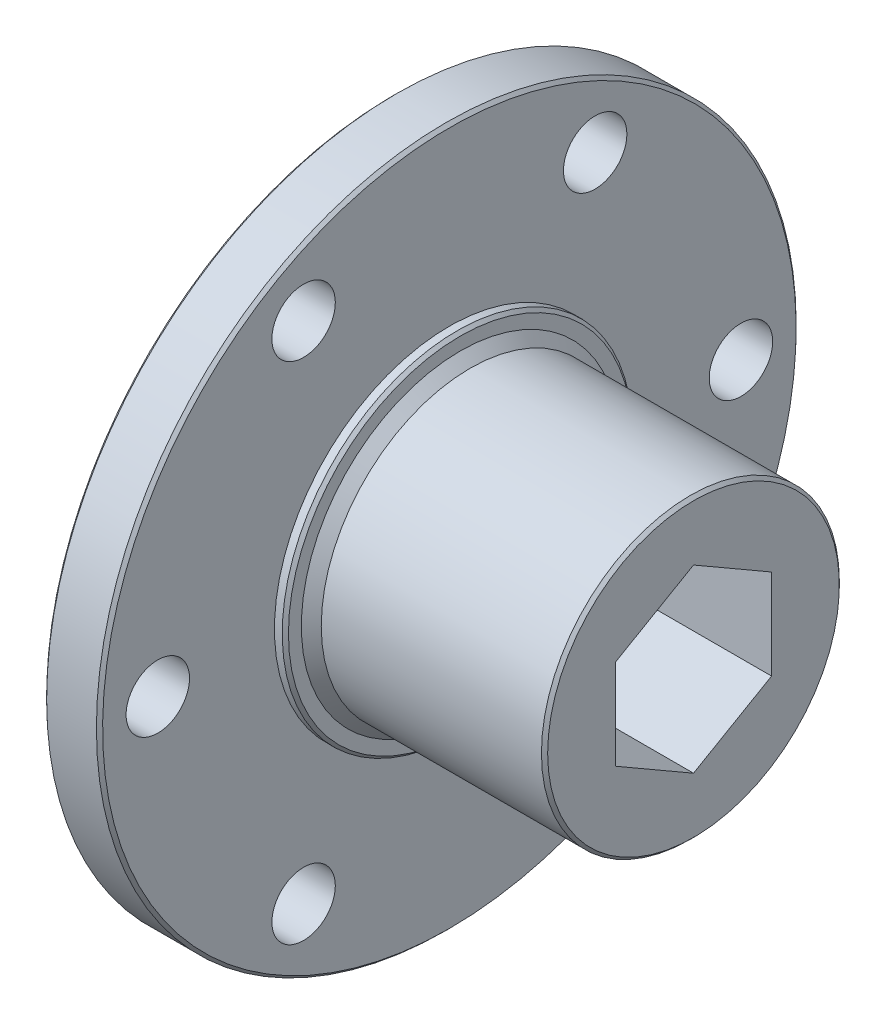
ISO-10303-21;
HEADER;
FILE_DESCRIPTION(('STEP AP214'),'2;1');
FILE_NAME('part.step','',(''),(''),'','','');
FILE_SCHEMA(('AUTOMOTIVE_DESIGN { 1 0 10303 214 1 1 1 1 }'));
ENDSEC;
DATA;
#1=APPLICATION_CONTEXT('core data for automotive mechanical design processes');
#2=APPLICATION_PROTOCOL_DEFINITION('international standard','automotive_design',2000,#1);
#3=PRODUCT_CONTEXT('',#1,'mechanical');
#4=PRODUCT('Part','Part','',(#3));
#5=PRODUCT_RELATED_PRODUCT_CATEGORY('part','',(#4));
#6=PRODUCT_DEFINITION_FORMATION('','',#4);
#7=PRODUCT_DEFINITION_CONTEXT('part definition',#1,'design');
#8=PRODUCT_DEFINITION('design','',#6,#7);
#9=PRODUCT_DEFINITION_SHAPE('','',#8);
#10=(LENGTH_UNIT() NAMED_UNIT(*) SI_UNIT(.MILLI.,.METRE.));
#11=(NAMED_UNIT(*) PLANE_ANGLE_UNIT() SI_UNIT($,.RADIAN.));
#12=(NAMED_UNIT(*) SI_UNIT($,.STERADIAN.) SOLID_ANGLE_UNIT());
#13=UNCERTAINTY_MEASURE_WITH_UNIT(LENGTH_MEASURE(1.E-05),#10,'distance_accuracy_value','');
#14=(GEOMETRIC_REPRESENTATION_CONTEXT(3) GLOBAL_UNCERTAINTY_ASSIGNED_CONTEXT((#13)) GLOBAL_UNIT_ASSIGNED_CONTEXT((#10,
#11,#12)) REPRESENTATION_CONTEXT('',''));
#15=CARTESIAN_POINT('',(0.,0.,0.));
#16=DIRECTION('',(0.,0.,1.));
#17=DIRECTION('',(1.,0.,0.));
#18=AXIS2_PLACEMENT_3D('',#15,#16,#17);
#19=CARTESIAN_POINT('',(6.01493375394323,0.,0.));
#20=DIRECTION('',(-1.,0.,0.));
#21=DIRECTION('',(0.,0.,1.));
#22=AXIS2_PLACEMENT_3D('',#19,#20,#21);
#23=CYLINDRICAL_SURFACE('',#22,12.1666);
#24=CARTESIAN_POINT('',(5.76093375394327,0.,0.));
#25=DIRECTION('',(-1.,0.,0.));
#26=DIRECTION('',(0.,0.,1.));
#27=AXIS2_PLACEMENT_3D('',#24,#25,#26);
#28=CIRCLE('',#27,12.1666);
#29=CARTESIAN_POINT('',(5.76093375394327,0.,12.1666));
#30=VERTEX_POINT('',#29);
#31=EDGE_CURVE('E102',#30,#30,#28,.F.);
#32=ORIENTED_EDGE('',*,*,#31,.F.);
#33=EDGE_LOOP('',(#32));
#34=FACE_BOUND('',#33,.T.);
#35=CARTESIAN_POINT('',(-12.2222662460567,0.,0.));
#36=DIRECTION('',(-1.,0.,0.));
#37=DIRECTION('',(0.,0.,1.));
#38=AXIS2_PLACEMENT_3D('',#35,#36,#37);
#39=CIRCLE('',#38,12.1666);
#40=CARTESIAN_POINT('',(-12.2222662460567,0.,12.1666));
#41=VERTEX_POINT('',#40);
#42=EDGE_CURVE('E99',#41,#41,#39,.T.);
#43=ORIENTED_EDGE('',*,*,#42,.F.);
#44=EDGE_LOOP('',(#43));
#45=FACE_BOUND('',#44,.T.);
#46=ADVANCED_FACE('F18',(#34,#45),#23,.T.);
#47=CARTESIAN_POINT('',(5.76093375394327,0.,0.));
#48=DIRECTION('',(-1.,0.,0.));
#49=DIRECTION('',(0.,0.,1.));
#50=AXIS2_PLACEMENT_3D('',#47,#48,#49);
#51=CONICAL_SURFACE('',#50,12.1666,0.785398163397465);
#52=ORIENTED_EDGE('',*,*,#31,.T.);
#53=EDGE_LOOP('',(#52));
#54=FACE_BOUND('',#53,.T.);
#55=CARTESIAN_POINT('',(6.01493375394323,0.,0.));
#56=DIRECTION('',(-1.,0.,0.));
#57=DIRECTION('',(0.,0.,1.));
#58=AXIS2_PLACEMENT_3D('',#55,#56,#57);
#59=CIRCLE('',#58,11.9126);
#60=CARTESIAN_POINT('',(6.01493375394323,0.,11.9126));
#61=VERTEX_POINT('',#60);
#62=EDGE_CURVE('E21',#61,#61,#59,.F.);
#63=ORIENTED_EDGE('',*,*,#62,.F.);
#64=EDGE_LOOP('',(#63));
#65=FACE_BOUND('',#64,.T.);
#66=ADVANCED_FACE('F165',(#54,#65),#51,.T.);
#67=CARTESIAN_POINT('',(-13.0350662460568,0.,0.));
#68=DIRECTION('',(-1.,0.,0.));
#69=DIRECTION('',(0.,-1.,0.));
#70=AXIS2_PLACEMENT_3D('',#67,#68,#69);
#71=CONICAL_SURFACE('',#70,12.9794,0.785398163397438);
#72=ORIENTED_EDGE('',*,*,#42,.T.);
#73=EDGE_LOOP('',(#72));
#74=FACE_BOUND('',#73,.T.);
#75=CARTESIAN_POINT('',(-13.0350662460568,0.,0.));
#76=DIRECTION('',(-1.,0.,0.));
#77=DIRECTION('',(0.,-1.,0.));
#78=AXIS2_PLACEMENT_3D('',#75,#76,#77);
#79=CIRCLE('',#78,12.9794);
#80=CARTESIAN_POINT('',(-13.0350662460568,-12.9794,0.));
#81=VERTEX_POINT('',#80);
#82=EDGE_CURVE('E84',#81,#81,#79,.T.);
#83=ORIENTED_EDGE('',*,*,#82,.F.);
#84=EDGE_LOOP('',(#83));
#85=FACE_BOUND('',#84,.T.);
#86=ADVANCED_FACE('F167',(#74,#85),#71,.T.);
#87=CARTESIAN_POINT('',(6.01493375394323,0.,0.));
#88=DIRECTION('',(1.,0.,0.));
#89=DIRECTION('',(0.,0.,-1.));
#90=AXIS2_PLACEMENT_3D('',#87,#88,#89);
#91=PLANE('',#90);
#92=DIRECTION('',(0.,1.,0.));
#93=VECTOR('',#92,1.);
#94=CARTESIAN_POINT('',(6.01493375394323,-3.68085890619153,-6.37539999999999));
#95=LINE('',#94,#93);
#96=CARTESIAN_POINT('',(6.01493375394323,3.68081890619155,-6.37539999999999));
#97=VERTEX_POINT('',#96);
#98=CARTESIAN_POINT('',(6.01493375394323,-3.68085890619153,-6.37539999999999));
#99=VERTEX_POINT('',#98);
#100=EDGE_CURVE('E93',#97,#99,#95,.F.);
#101=ORIENTED_EDGE('',*,*,#100,.T.);
#102=DIRECTION('',(0.,0.500000000000001,-0.866025403784438));
#103=VECTOR('',#102,1.);
#104=CARTESIAN_POINT('',(6.01493375394323,-7.36169781238308,0.));
#105=LINE('',#104,#103);
#106=CARTESIAN_POINT('',(6.01493375394323,-7.36169781238308,0.));
#107=VERTEX_POINT('',#106);
#108=EDGE_CURVE('E69',#99,#107,#105,.F.);
#109=ORIENTED_EDGE('',*,*,#108,.T.);
#110=DIRECTION('',(0.,-0.500000000000001,-0.866025403784438));
#111=VECTOR('',#110,1.);
#112=CARTESIAN_POINT('',(6.01493375394323,-3.68085890619153,6.3754));
#113=LINE('',#112,#111);
#114=CARTESIAN_POINT('',(6.01493375394323,-3.68085890619153,6.3754));
#115=VERTEX_POINT('',#114);
#116=EDGE_CURVE('E75',#107,#115,#113,.F.);
#117=ORIENTED_EDGE('',*,*,#116,.T.);
#118=DIRECTION('',(0.,-1.,0.));
#119=VECTOR('',#118,1.);
#120=CARTESIAN_POINT('',(6.01493375394323,3.68081890619155,6.3754));
#121=LINE('',#120,#119);
#122=CARTESIAN_POINT('',(6.01493375394323,3.68081890619155,6.3754));
#123=VERTEX_POINT('',#122);
#124=EDGE_CURVE('E158',#115,#123,#121,.F.);
#125=ORIENTED_EDGE('',*,*,#124,.T.);
#126=DIRECTION('',(0.,-0.500000000000001,0.866025403784438));
#127=VECTOR('',#126,1.);
#128=CARTESIAN_POINT('',(6.01493375394323,7.3616578123831,0.));
#129=LINE('',#128,#127);
#130=CARTESIAN_POINT('',(6.01493375394323,7.3616578123831,0.));
#131=VERTEX_POINT('',#130);
#132=EDGE_CURVE('E455',#123,#131,#129,.F.);
#133=ORIENTED_EDGE('',*,*,#132,.T.);
#134=DIRECTION('',(0.,0.500000000000001,0.866025403784438));
#135=VECTOR('',#134,1.);
#136=CARTESIAN_POINT('',(6.01493375394323,3.68081890619155,-6.37539999999999));
#137=LINE('',#136,#135);
#138=EDGE_CURVE('E461',#131,#97,#137,.F.);
#139=ORIENTED_EDGE('',*,*,#138,.T.);
#140=EDGE_LOOP('',(#101,#109,#117,#125,#133,#139));
#141=FACE_BOUND('',#140,.T.);
#142=ORIENTED_EDGE('',*,*,#62,.T.);
#143=EDGE_LOOP('',(#142));
#144=FACE_BOUND('',#143,.T.);
#145=ADVANCED_FACE('F90',(#141,#144),#91,.T.);
#146=CARTESIAN_POINT('',(-13.0350662460568,28.575,0.));
#147=DIRECTION('',(1.,0.,0.));
#148=DIRECTION('',(0.,0.,-1.));
#149=AXIS2_PLACEMENT_3D('',#146,#147,#148);
#150=PLANE('',#149);
#151=ORIENTED_EDGE('',*,*,#82,.T.);
#152=EDGE_LOOP('',(#151));
#153=FACE_BOUND('',#152,.T.);
#154=CARTESIAN_POINT('',(-13.0350662460568,0.,0.));
#155=DIRECTION('',(-1.,0.,0.));
#156=DIRECTION('',(0.,-1.,0.));
#157=AXIS2_PLACEMENT_3D('',#154,#155,#156);
#158=CIRCLE('',#157,14.0335);
#159=CARTESIAN_POINT('',(-13.0350662460568,-14.0335,0.));
#160=VERTEX_POINT('',#159);
#161=EDGE_CURVE('E155',#160,#160,#158,.T.);
#162=ORIENTED_EDGE('',*,*,#161,.F.);
#163=EDGE_LOOP('',(#162));
#164=FACE_BOUND('',#163,.T.);
#165=ADVANCED_FACE('F265',(#153,#164),#150,.T.);
#166=CARTESIAN_POINT('',(-19.3850662460568,-3.68085890619153,6.3754));
#167=DIRECTION('',(0.,-0.866025403784438,0.500000000000001));
#168=DIRECTION('',(0.,-0.500000000000001,-0.866025403784438));
#169=AXIS2_PLACEMENT_3D('',#166,#167,#168);
#170=PLANE('',#169);
#171=DIRECTION('',(1.,0.,0.));
#172=VECTOR('',#171,1.);
#173=CARTESIAN_POINT('',(-19.3850662460568,-7.36169781238308,0.));
#174=LINE('',#173,#172);
#175=CARTESIAN_POINT('',(-19.3850662460568,-7.36169781238308,0.));
#176=VERTEX_POINT('',#175);
#177=EDGE_CURVE('E78',#107,#176,#174,.F.);
#178=ORIENTED_EDGE('',*,*,#177,.T.);
#179=DIRECTION('',(0.,-0.500000000000001,-0.866025403784438));
#180=VECTOR('',#179,1.);
#181=CARTESIAN_POINT('',(-19.3850662460568,-3.68085890619153,6.3754));
#182=LINE('',#181,#180);
#183=CARTESIAN_POINT('',(-19.3850662460568,-3.68085890619153,6.3754));
#184=VERTEX_POINT('',#183);
#185=EDGE_CURVE('E157',#184,#176,#182,.T.);
#186=ORIENTED_EDGE('',*,*,#185,.F.);
#187=DIRECTION('',(1.,0.,0.));
#188=VECTOR('',#187,1.);
#189=CARTESIAN_POINT('',(-19.3850662460568,-3.68085890619153,6.3754));
#190=LINE('',#189,#188);
#191=EDGE_CURVE('E80',#184,#115,#190,.T.);
#192=ORIENTED_EDGE('',*,*,#191,.T.);
#193=ORIENTED_EDGE('',*,*,#116,.F.);
#194=EDGE_LOOP('',(#178,#186,#192,#193));
#195=FACE_BOUND('',#194,.T.);
#196=ADVANCED_FACE('F76',(#195),#170,.F.);
#197=CARTESIAN_POINT('',(-19.3850662460568,-7.36169781238308,0.));
#198=DIRECTION('',(0.,-0.866025403784438,-0.500000000000001));
#199=DIRECTION('',(0.,0.500000000000001,-0.866025403784438));
#200=AXIS2_PLACEMENT_3D('',#197,#198,#199);
#201=PLANE('',#200);
#202=DIRECTION('',(1.,0.,0.));
#203=VECTOR('',#202,1.);
#204=CARTESIAN_POINT('',(-19.3850662460568,-3.68085890619153,-6.37539999999999));
#205=LINE('',#204,#203);
#206=CARTESIAN_POINT('',(-19.3850662460568,-3.68085890619153,-6.37539999999999));
#207=VERTEX_POINT('',#206);
#208=EDGE_CURVE('E94',#99,#207,#205,.F.);
#209=ORIENTED_EDGE('',*,*,#208,.T.);
#210=DIRECTION('',(0.,0.500000000000001,-0.866025403784438));
#211=VECTOR('',#210,1.);
#212=CARTESIAN_POINT('',(-19.3850662460568,-7.36169781238308,0.));
#213=LINE('',#212,#211);
#214=EDGE_CURVE('E87',#176,#207,#213,.T.);
#215=ORIENTED_EDGE('',*,*,#214,.F.);
#216=ORIENTED_EDGE('',*,*,#177,.F.);
#217=ORIENTED_EDGE('',*,*,#108,.F.);
#218=EDGE_LOOP('',(#209,#215,#216,#217));
#219=FACE_BOUND('',#218,.T.);
#220=ADVANCED_FACE('F86',(#219),#201,.F.);
#221=CARTESIAN_POINT('',(-19.3850662460568,-3.68085890619153,-6.37539999999999));
#222=DIRECTION('',(0.,0.,-1.));
#223=DIRECTION('',(0.,1.,0.));
#224=AXIS2_PLACEMENT_3D('',#221,#222,#223);
#225=PLANE('',#224);
#226=DIRECTION('',(1.,0.,0.));
#227=VECTOR('',#226,1.);
#228=CARTESIAN_POINT('',(-19.3850662460568,3.68081890619155,-6.37539999999999));
#229=LINE('',#228,#227);
#230=CARTESIAN_POINT('',(-19.3850662460568,3.68081890619155,-6.37539999999999));
#231=VERTEX_POINT('',#230);
#232=EDGE_CURVE('E463',#97,#231,#229,.F.);
#233=ORIENTED_EDGE('',*,*,#232,.T.);
#234=DIRECTION('',(0.,1.,0.));
#235=VECTOR('',#234,1.);
#236=CARTESIAN_POINT('',(-19.3850662460568,0.,-6.37539999999999));
#237=LINE('',#236,#235);
#238=EDGE_CURVE('E468',#207,#231,#237,.T.);
#239=ORIENTED_EDGE('',*,*,#238,.F.);
#240=ORIENTED_EDGE('',*,*,#208,.F.);
#241=ORIENTED_EDGE('',*,*,#100,.F.);
#242=EDGE_LOOP('',(#233,#239,#240,#241));
#243=FACE_BOUND('',#242,.T.);
#244=ADVANCED_FACE('F256',(#243),#225,.F.);
#245=CARTESIAN_POINT('',(-19.3850662460568,3.68081890619155,-6.37539999999999));
#246=DIRECTION('',(0.,0.866025403784438,-0.500000000000001));
#247=DIRECTION('',(0.,0.500000000000001,0.866025403784438));
#248=AXIS2_PLACEMENT_3D('',#245,#246,#247);
#249=PLANE('',#248);
#250=DIRECTION('',(1.,0.,0.));
#251=VECTOR('',#250,1.);
#252=CARTESIAN_POINT('',(-19.3850662460568,7.3616578123831,0.));
#253=LINE('',#252,#251);
#254=CARTESIAN_POINT('',(-19.3850662460568,7.3616578123831,0.));
#255=VERTEX_POINT('',#254);
#256=EDGE_CURVE('E458',#131,#255,#253,.F.);
#257=ORIENTED_EDGE('',*,*,#256,.T.);
#258=DIRECTION('',(0.,0.500000000000001,0.866025403784438));
#259=VECTOR('',#258,1.);
#260=CARTESIAN_POINT('',(-19.3850662460568,3.68081890619155,-6.37539999999999));
#261=LINE('',#260,#259);
#262=EDGE_CURVE('E469',#231,#255,#261,.T.);
#263=ORIENTED_EDGE('',*,*,#262,.F.);
#264=ORIENTED_EDGE('',*,*,#232,.F.);
#265=ORIENTED_EDGE('',*,*,#138,.F.);
#266=EDGE_LOOP('',(#257,#263,#264,#265));
#267=FACE_BOUND('',#266,.T.);
#268=ADVANCED_FACE('F252',(#267),#249,.F.);
#269=CARTESIAN_POINT('',(-19.3850662460568,7.3616578123831,0.));
#270=DIRECTION('',(0.,0.866025403784438,0.500000000000001));
#271=DIRECTION('',(0.,-0.500000000000001,0.866025403784438));
#272=AXIS2_PLACEMENT_3D('',#269,#270,#271);
#273=PLANE('',#272);
#274=DIRECTION('',(1.,0.,0.));
#275=VECTOR('',#274,1.);
#276=CARTESIAN_POINT('',(-19.3850662460568,3.68081890619155,6.3754));
#277=LINE('',#276,#275);
#278=CARTESIAN_POINT('',(-19.3850662460568,3.68081890619155,6.3754));
#279=VERTEX_POINT('',#278);
#280=EDGE_CURVE('E453',#123,#279,#277,.F.);
#281=ORIENTED_EDGE('',*,*,#280,.T.);
#282=DIRECTION('',(0.,-0.500000000000001,0.866025403784438));
#283=VECTOR('',#282,1.);
#284=CARTESIAN_POINT('',(-19.3850662460568,7.3616578123831,0.));
#285=LINE('',#284,#283);
#286=EDGE_CURVE('E36',#255,#279,#285,.T.);
#287=ORIENTED_EDGE('',*,*,#286,.F.);
#288=ORIENTED_EDGE('',*,*,#256,.F.);
#289=ORIENTED_EDGE('',*,*,#132,.F.);
#290=EDGE_LOOP('',(#281,#287,#288,#289));
#291=FACE_BOUND('',#290,.T.);
#292=ADVANCED_FACE('F248',(#291),#273,.F.);
#293=CARTESIAN_POINT('',(-19.3850662460568,3.68081890619155,6.3754));
#294=DIRECTION('',(0.,0.,1.));
#295=DIRECTION('',(0.,-1.,0.));
#296=AXIS2_PLACEMENT_3D('',#293,#294,#295);
#297=PLANE('',#296);
#298=ORIENTED_EDGE('',*,*,#191,.F.);
#299=DIRECTION('',(0.,1.,0.));
#300=VECTOR('',#299,1.);
#301=CARTESIAN_POINT('',(-19.3850662460568,0.,6.3754));
#302=LINE('',#301,#300);
#303=EDGE_CURVE('E444',#279,#184,#302,.F.);
#304=ORIENTED_EDGE('',*,*,#303,.F.);
#305=ORIENTED_EDGE('',*,*,#280,.F.);
#306=ORIENTED_EDGE('',*,*,#124,.F.);
#307=EDGE_LOOP('',(#298,#304,#305,#306));
#308=FACE_BOUND('',#307,.T.);
#309=ADVANCED_FACE('F244',(#308),#297,.F.);
#310=CARTESIAN_POINT('',(-13.2890662460568,0.,0.));
#311=DIRECTION('',(-1.,0.,0.));
#312=DIRECTION('',(0.,-1.,0.));
#313=AXIS2_PLACEMENT_3D('',#310,#311,#312);
#314=CONICAL_SURFACE('',#313,14.2875,0.785398163397452);
#315=ORIENTED_EDGE('',*,*,#161,.T.);
#316=EDGE_LOOP('',(#315));
#317=FACE_BOUND('',#316,.T.);
#318=CARTESIAN_POINT('',(-13.2890662460568,0.,0.));
#319=DIRECTION('',(1.,0.,0.));
#320=DIRECTION('',(0.,0.,-1.));
#321=AXIS2_PLACEMENT_3D('',#318,#319,#320);
#322=CIRCLE('',#321,14.2875);
#323=CARTESIAN_POINT('',(-13.2890662460568,0.,-14.2875));
#324=VERTEX_POINT('',#323);
#325=EDGE_CURVE('E442',#324,#324,#322,.F.);
#326=ORIENTED_EDGE('',*,*,#325,.F.);
#327=EDGE_LOOP('',(#326));
#328=FACE_BOUND('',#327,.T.);
#329=ADVANCED_FACE('F241',(#317,#328),#314,.T.);
#330=CARTESIAN_POINT('',(-19.3850662460568,0.,0.));
#331=DIRECTION('',(-1.,0.,0.));
#332=DIRECTION('',(0.,0.,1.));
#333=AXIS2_PLACEMENT_3D('',#330,#331,#332);
#334=PLANE('',#333);
#335=ORIENTED_EDGE('',*,*,#286,.T.);
#336=ORIENTED_EDGE('',*,*,#303,.T.);
#337=ORIENTED_EDGE('',*,*,#185,.T.);
#338=ORIENTED_EDGE('',*,*,#214,.T.);
#339=ORIENTED_EDGE('',*,*,#238,.T.);
#340=ORIENTED_EDGE('',*,*,#262,.T.);
#341=EDGE_LOOP('',(#335,#336,#337,#338,#339,#340));
#342=FACE_BOUND('',#341,.T.);
#343=CARTESIAN_POINT('',(-19.3850662460568,0.,0.));
#344=DIRECTION('',(1.,0.,0.));
#345=DIRECTION('',(0.,0.,-1.));
#346=AXIS2_PLACEMENT_3D('',#343,#344,#345);
#347=CIRCLE('',#346,14.0335);
#348=CARTESIAN_POINT('',(-19.3850662460568,0.,-14.0335));
#349=VERTEX_POINT('',#348);
#350=EDGE_CURVE('E151',#349,#349,#347,.T.);
#351=ORIENTED_EDGE('',*,*,#350,.F.);
#352=EDGE_LOOP('',(#351));
#353=FACE_BOUND('',#352,.T.);
#354=ADVANCED_FACE('F237',(#342,#353),#334,.T.);
#355=CARTESIAN_POINT('',(-14.1780662460568,0.,0.));
#356=DIRECTION('',(-1.,0.,0.));
#357=DIRECTION('',(0.,-1.,0.));
#358=AXIS2_PLACEMENT_3D('',#355,#356,#357);
#359=CONICAL_SURFACE('',#358,28.575,0.785398163397445);
#360=CARTESIAN_POINT('',(-14.1780662460568,0.,0.));
#361=DIRECTION('',(-1.,0.,0.));
#362=DIRECTION('',(0.,0.,1.));
#363=AXIS2_PLACEMENT_3D('',#360,#361,#362);
#364=CIRCLE('',#363,28.575);
#365=CARTESIAN_POINT('',(-14.1780662460568,0.,28.575));
#366=VERTEX_POINT('',#365);
#367=EDGE_CURVE('E154',#366,#366,#364,.T.);
#368=ORIENTED_EDGE('',*,*,#367,.F.);
#369=EDGE_LOOP('',(#368));
#370=FACE_BOUND('',#369,.T.);
#371=CARTESIAN_POINT('',(-13.9240662460568,0.,0.));
#372=DIRECTION('',(-1.,0.,0.));
#373=DIRECTION('',(0.,-1.,0.));
#374=AXIS2_PLACEMENT_3D('',#371,#372,#373);
#375=CIRCLE('',#374,28.321);
#376=CARTESIAN_POINT('',(-13.9240662460568,-28.321,0.));
#377=VERTEX_POINT('',#376);
#378=EDGE_CURVE('E148',#377,#377,#375,.F.);
#379=ORIENTED_EDGE('',*,*,#378,.F.);
#380=EDGE_LOOP('',(#379));
#381=FACE_BOUND('',#380,.T.);
#382=ADVANCED_FACE('F233',(#370,#381),#359,.T.);
#383=CARTESIAN_POINT('',(14.3030238953624,0.,0.));
#384=DIRECTION('',(1.,0.,0.));
#385=DIRECTION('',(0.,0.,-1.));
#386=AXIS2_PLACEMENT_3D('',#383,#384,#385);
#387=CYLINDRICAL_SURFACE('',#386,14.2875);
#388=CARTESIAN_POINT('',(-13.9240662460568,0.,0.));
#389=DIRECTION('',(1.,0.,0.));
#390=DIRECTION('',(0.,0.,-1.));
#391=AXIS2_PLACEMENT_3D('',#388,#389,#390);
#392=CIRCLE('',#391,14.2875);
#393=CARTESIAN_POINT('',(-13.9240662460568,0.,-14.2875));
#394=VERTEX_POINT('',#393);
#395=EDGE_CURVE('E145',#394,#394,#392,.F.);
#396=ORIENTED_EDGE('',*,*,#395,.F.);
#397=EDGE_LOOP('',(#396));
#398=FACE_BOUND('',#397,.T.);
#399=ORIENTED_EDGE('',*,*,#325,.T.);
#400=EDGE_LOOP('',(#399));
#401=FACE_BOUND('',#400,.T.);
#402=ADVANCED_FACE('F229',(#398,#401),#387,.T.);
#403=CARTESIAN_POINT('',(-13.0350662460568,0.,0.));
#404=DIRECTION('',(-1.,0.,0.));
#405=DIRECTION('',(0.,0.,1.));
#406=AXIS2_PLACEMENT_3D('',#403,#404,#405);
#407=CYLINDRICAL_SURFACE('',#406,28.575);
#408=ORIENTED_EDGE('',*,*,#367,.T.);
#409=EDGE_LOOP('',(#408));
#410=FACE_BOUND('',#409,.T.);
#411=CARTESIAN_POINT('',(-18.2420662460568,0.,0.));
#412=DIRECTION('',(1.,0.,0.));
#413=DIRECTION('',(0.,0.,-1.));
#414=AXIS2_PLACEMENT_3D('',#411,#412,#413);
#415=CIRCLE('',#414,28.575);
#416=CARTESIAN_POINT('',(-18.2420662460568,0.,-28.575));
#417=VERTEX_POINT('',#416);
#418=EDGE_CURVE('E144',#417,#417,#415,.F.);
#419=ORIENTED_EDGE('',*,*,#418,.F.);
#420=EDGE_LOOP('',(#419));
#421=FACE_BOUND('',#420,.T.);
#422=ADVANCED_FACE('F225',(#410,#421),#407,.T.);
#423=CARTESIAN_POINT('',(-19.1310662460568,0.,0.));
#424=DIRECTION('',(1.,0.,0.));
#425=DIRECTION('',(0.,0.,-1.));
#426=AXIS2_PLACEMENT_3D('',#423,#424,#425);
#427=CONICAL_SURFACE('',#426,14.2875,0.785398163397452);
#428=CARTESIAN_POINT('',(-19.1310662460568,0.,0.));
#429=DIRECTION('',(1.,0.,0.));
#430=DIRECTION('',(0.,0.,-1.));
#431=AXIS2_PLACEMENT_3D('',#428,#429,#430);
#432=CIRCLE('',#431,14.2875);
#433=CARTESIAN_POINT('',(-19.1310662460568,0.,-14.2875));
#434=VERTEX_POINT('',#433);
#435=EDGE_CURVE('E134',#434,#434,#432,.T.);
#436=ORIENTED_EDGE('',*,*,#435,.F.);
#437=EDGE_LOOP('',(#436));
#438=FACE_BOUND('',#437,.T.);
#439=ORIENTED_EDGE('',*,*,#350,.T.);
#440=EDGE_LOOP('',(#439));
#441=FACE_BOUND('',#440,.T.);
#442=ADVANCED_FACE('F221',(#438,#441),#427,.T.);
#443=CARTESIAN_POINT('',(-13.9240662460568,0.,5.72637987752451));
#444=DIRECTION('',(1.,0.,0.));
#445=DIRECTION('',(0.,0.,-1.));
#446=AXIS2_PLACEMENT_3D('',#443,#444,#445);
#447=PLANE('',#446);
#448=CARTESIAN_POINT('',(-13.9240662460568,0.,23.8125));
#449=DIRECTION('',(1.,0.,0.));
#450=DIRECTION('',(0.,0.,-1.));
#451=AXIS2_PLACEMENT_3D('',#448,#449,#450);
#452=CIRCLE('',#451,2.59080000000001);
#453=CARTESIAN_POINT('',(-13.9240662460568,0.,21.2217));
#454=VERTEX_POINT('',#453);
#455=EDGE_CURVE('E125',#454,#454,#452,.F.);
#456=ORIENTED_EDGE('',*,*,#455,.T.);
#457=EDGE_LOOP('',(#456));
#458=FACE_BOUND('',#457,.T.);
#459=CARTESIAN_POINT('',(-13.9240662460568,20.622229927617,-11.90625));
#460=DIRECTION('',(1.,0.,0.));
#461=DIRECTION('',(0.,0.,-1.));
#462=AXIS2_PLACEMENT_3D('',#459,#460,#461);
#463=CIRCLE('',#462,2.59080000000001);
#464=CARTESIAN_POINT('',(-13.9240662460568,20.622229927617,-14.49705));
#465=VERTEX_POINT('',#464);
#466=EDGE_CURVE('E128',#465,#465,#463,.F.);
#467=ORIENTED_EDGE('',*,*,#466,.T.);
#468=EDGE_LOOP('',(#467));
#469=FACE_BOUND('',#468,.T.);
#470=CARTESIAN_POINT('',(-13.9240662460568,-20.6222299276169,-11.90625));
#471=DIRECTION('',(1.,0.,0.));
#472=DIRECTION('',(0.,0.,-1.));
#473=AXIS2_PLACEMENT_3D('',#470,#471,#472);
#474=CIRCLE('',#473,2.59080000000001);
#475=CARTESIAN_POINT('',(-13.9240662460568,-20.6222299276169,-14.4970500000001));
#476=VERTEX_POINT('',#475);
#477=EDGE_CURVE('E131',#476,#476,#474,.F.);
#478=ORIENTED_EDGE('',*,*,#477,.T.);
#479=EDGE_LOOP('',(#478));
#480=FACE_BOUND('',#479,.T.);
#481=ORIENTED_EDGE('',*,*,#395,.T.);
#482=EDGE_LOOP('',(#481));
#483=FACE_BOUND('',#482,.T.);
#484=CARTESIAN_POINT('',(-13.9240662460568,-20.622229927617,11.9062499999999));
#485=DIRECTION('',(1.,0.,0.));
#486=DIRECTION('',(0.,0.,-1.));
#487=AXIS2_PLACEMENT_3D('',#484,#485,#486);
#488=CIRCLE('',#487,2.59080000000001);
#489=CARTESIAN_POINT('',(-13.9240662460568,-20.622229927617,9.31544999999993));
#490=VERTEX_POINT('',#489);
#491=EDGE_CURVE('E135',#490,#490,#488,.F.);
#492=ORIENTED_EDGE('',*,*,#491,.T.);
#493=EDGE_LOOP('',(#492));
#494=FACE_BOUND('',#493,.T.);
#495=CARTESIAN_POINT('',(-13.9240662460568,0.,-23.8125));
#496=DIRECTION('',(1.,0.,0.));
#497=DIRECTION('',(0.,0.,-1.));
#498=AXIS2_PLACEMENT_3D('',#495,#496,#497);
#499=CIRCLE('',#498,2.59080000000001);
#500=CARTESIAN_POINT('',(-13.9240662460568,0.,-26.4033));
#501=VERTEX_POINT('',#500);
#502=EDGE_CURVE('E138',#501,#501,#499,.F.);
#503=ORIENTED_EDGE('',*,*,#502,.T.);
#504=EDGE_LOOP('',(#503));
#505=FACE_BOUND('',#504,.T.);
#506=CARTESIAN_POINT('',(-13.9240662460568,20.6222299276169,11.90625));
#507=DIRECTION('',(1.,0.,0.));
#508=DIRECTION('',(0.,0.,-1.));
#509=AXIS2_PLACEMENT_3D('',#506,#507,#508);
#510=CIRCLE('',#509,2.59080000000001);
#511=CARTESIAN_POINT('',(-13.9240662460568,20.6222299276169,9.31544999999999));
#512=VERTEX_POINT('',#511);
#513=EDGE_CURVE('E141',#512,#512,#510,.F.);
#514=ORIENTED_EDGE('',*,*,#513,.T.);
#515=EDGE_LOOP('',(#514));
#516=FACE_BOUND('',#515,.T.);
#517=ORIENTED_EDGE('',*,*,#378,.T.);
#518=EDGE_LOOP('',(#517));
#519=FACE_BOUND('',#518,.T.);
#520=ADVANCED_FACE('F217',(#458,#469,#480,#483,#494,#505,#516,#519),#447,.T.);
#521=CARTESIAN_POINT('',(-18.2420662460568,0.,0.));
#522=DIRECTION('',(1.,0.,0.));
#523=DIRECTION('',(0.,0.,-1.));
#524=AXIS2_PLACEMENT_3D('',#521,#522,#523);
#525=CONICAL_SURFACE('',#524,28.575,0.785398163397448);
#526=CARTESIAN_POINT('',(-18.4960662460568,0.,0.));
#527=DIRECTION('',(1.,0.,0.));
#528=DIRECTION('',(0.,0.,-1.));
#529=AXIS2_PLACEMENT_3D('',#526,#527,#528);
#530=CIRCLE('',#529,28.321);
#531=CARTESIAN_POINT('',(-18.4960662460568,0.,-28.321));
#532=VERTEX_POINT('',#531);
#533=EDGE_CURVE('E122',#532,#532,#530,.T.);
#534=ORIENTED_EDGE('',*,*,#533,.T.);
#535=EDGE_LOOP('',(#534));
#536=FACE_BOUND('',#535,.T.);
#537=ORIENTED_EDGE('',*,*,#418,.T.);
#538=EDGE_LOOP('',(#537));
#539=FACE_BOUND('',#538,.T.);
#540=ADVANCED_FACE('F213',(#536,#539),#525,.T.);
#541=CARTESIAN_POINT('',(-13.0350662460568,20.6222299276169,11.90625));
#542=DIRECTION('',(1.,0.,0.));
#543=DIRECTION('',(0.,0.,-1.));
#544=AXIS2_PLACEMENT_3D('',#541,#542,#543);
#545=CYLINDRICAL_SURFACE('',#544,2.59080000000001);
#546=ORIENTED_EDGE('',*,*,#513,.F.);
#547=EDGE_LOOP('',(#546));
#548=FACE_BOUND('',#547,.T.);
#549=CARTESIAN_POINT('',(-18.4960662460568,20.6222299276169,11.90625));
#550=DIRECTION('',(1.,0.,0.));
#551=DIRECTION('',(0.,0.,-1.));
#552=AXIS2_PLACEMENT_3D('',#549,#550,#551);
#553=CIRCLE('',#552,2.59080000000001);
#554=CARTESIAN_POINT('',(-18.4960662460568,20.6222299276169,9.31544999999999));
#555=VERTEX_POINT('',#554);
#556=EDGE_CURVE('E119',#555,#555,#553,.F.);
#557=ORIENTED_EDGE('',*,*,#556,.T.);
#558=EDGE_LOOP('',(#557));
#559=FACE_BOUND('',#558,.T.);
#560=ADVANCED_FACE('F209',(#548,#559),#545,.F.);
#561=CARTESIAN_POINT('',(-13.0350662460568,0.,-23.8125));
#562=DIRECTION('',(1.,0.,0.));
#563=DIRECTION('',(0.,0.,-1.));
#564=AXIS2_PLACEMENT_3D('',#561,#562,#563);
#565=CYLINDRICAL_SURFACE('',#564,2.59080000000001);
#566=ORIENTED_EDGE('',*,*,#502,.F.);
#567=EDGE_LOOP('',(#566));
#568=FACE_BOUND('',#567,.T.);
#569=CARTESIAN_POINT('',(-18.4960662460568,0.,-23.8125));
#570=DIRECTION('',(1.,0.,0.));
#571=DIRECTION('',(0.,0.,-1.));
#572=AXIS2_PLACEMENT_3D('',#569,#570,#571);
#573=CIRCLE('',#572,2.59080000000001);
#574=CARTESIAN_POINT('',(-18.4960662460568,0.,-26.4033));
#575=VERTEX_POINT('',#574);
#576=EDGE_CURVE('E116',#575,#575,#573,.F.);
#577=ORIENTED_EDGE('',*,*,#576,.T.);
#578=EDGE_LOOP('',(#577));
#579=FACE_BOUND('',#578,.T.);
#580=ADVANCED_FACE('F205',(#568,#579),#565,.F.);
#581=CARTESIAN_POINT('',(-13.0350662460568,-20.622229927617,11.9062499999999));
#582=DIRECTION('',(1.,0.,0.));
#583=DIRECTION('',(0.,0.,-1.));
#584=AXIS2_PLACEMENT_3D('',#581,#582,#583);
#585=CYLINDRICAL_SURFACE('',#584,2.59080000000001);
#586=ORIENTED_EDGE('',*,*,#491,.F.);
#587=EDGE_LOOP('',(#586));
#588=FACE_BOUND('',#587,.T.);
#589=CARTESIAN_POINT('',(-18.4960662460568,-20.622229927617,11.9062499999999));
#590=DIRECTION('',(1.,0.,0.));
#591=DIRECTION('',(0.,0.,-1.));
#592=AXIS2_PLACEMENT_3D('',#589,#590,#591);
#593=CIRCLE('',#592,2.59080000000001);
#594=CARTESIAN_POINT('',(-18.4960662460568,-20.622229927617,9.31544999999993));
#595=VERTEX_POINT('',#594);
#596=EDGE_CURVE('E113',#595,#595,#593,.F.);
#597=ORIENTED_EDGE('',*,*,#596,.T.);
#598=EDGE_LOOP('',(#597));
#599=FACE_BOUND('',#598,.T.);
#600=ADVANCED_FACE('F201',(#588,#599),#585,.F.);
#601=CARTESIAN_POINT('',(14.3030238953624,0.,0.));
#602=DIRECTION('',(1.,0.,0.));
#603=DIRECTION('',(0.,0.,-1.));
#604=AXIS2_PLACEMENT_3D('',#601,#602,#603);
#605=CYLINDRICAL_SURFACE('',#604,14.2875);
#606=CARTESIAN_POINT('',(-18.4960662460568,0.,0.));
#607=DIRECTION('',(1.,0.,0.));
#608=DIRECTION('',(0.,0.,-1.));
#609=AXIS2_PLACEMENT_3D('',#606,#607,#608);
#610=CIRCLE('',#609,14.2875);
#611=CARTESIAN_POINT('',(-18.4960662460568,0.,-14.2875));
#612=VERTEX_POINT('',#611);
#613=EDGE_CURVE('E110',#612,#612,#610,.F.);
#614=ORIENTED_EDGE('',*,*,#613,.T.);
#615=EDGE_LOOP('',(#614));
#616=FACE_BOUND('',#615,.T.);
#617=ORIENTED_EDGE('',*,*,#435,.T.);
#618=EDGE_LOOP('',(#617));
#619=FACE_BOUND('',#618,.T.);
#620=ADVANCED_FACE('F197',(#616,#619),#605,.T.);
#621=CARTESIAN_POINT('',(-13.0350662460568,-20.6222299276169,-11.90625));
#622=DIRECTION('',(1.,0.,0.));
#623=DIRECTION('',(0.,0.,-1.));
#624=AXIS2_PLACEMENT_3D('',#621,#622,#623);
#625=CYLINDRICAL_SURFACE('',#624,2.59080000000001);
#626=ORIENTED_EDGE('',*,*,#477,.F.);
#627=EDGE_LOOP('',(#626));
#628=FACE_BOUND('',#627,.T.);
#629=CARTESIAN_POINT('',(-18.4960662460568,-20.6222299276169,-11.90625));
#630=DIRECTION('',(1.,0.,0.));
#631=DIRECTION('',(0.,0.,-1.));
#632=AXIS2_PLACEMENT_3D('',#629,#630,#631);
#633=CIRCLE('',#632,2.59080000000001);
#634=CARTESIAN_POINT('',(-18.4960662460568,-20.6222299276169,-14.4970500000001));
#635=VERTEX_POINT('',#634);
#636=EDGE_CURVE('E107',#635,#635,#633,.F.);
#637=ORIENTED_EDGE('',*,*,#636,.T.);
#638=EDGE_LOOP('',(#637));
#639=FACE_BOUND('',#638,.T.);
#640=ADVANCED_FACE('F193',(#628,#639),#625,.F.);
#641=CARTESIAN_POINT('',(-13.0350662460568,20.622229927617,-11.90625));
#642=DIRECTION('',(1.,0.,0.));
#643=DIRECTION('',(0.,0.,-1.));
#644=AXIS2_PLACEMENT_3D('',#641,#642,#643);
#645=CYLINDRICAL_SURFACE('',#644,2.59080000000001);
#646=ORIENTED_EDGE('',*,*,#466,.F.);
#647=EDGE_LOOP('',(#646));
#648=FACE_BOUND('',#647,.T.);
#649=CARTESIAN_POINT('',(-18.4960662460568,20.622229927617,-11.90625));
#650=DIRECTION('',(1.,0.,0.));
#651=DIRECTION('',(0.,0.,-1.));
#652=AXIS2_PLACEMENT_3D('',#649,#650,#651);
#653=CIRCLE('',#652,2.59080000000001);
#654=CARTESIAN_POINT('',(-18.4960662460568,20.622229927617,-14.49705));
#655=VERTEX_POINT('',#654);
#656=EDGE_CURVE('E27',#655,#655,#653,.F.);
#657=ORIENTED_EDGE('',*,*,#656,.T.);
#658=EDGE_LOOP('',(#657));
#659=FACE_BOUND('',#658,.T.);
#660=ADVANCED_FACE('F185',(#648,#659),#645,.F.);
#661=CARTESIAN_POINT('',(-13.0350662460568,0.,23.8125));
#662=DIRECTION('',(1.,0.,0.));
#663=DIRECTION('',(0.,0.,-1.));
#664=AXIS2_PLACEMENT_3D('',#661,#662,#663);
#665=CYLINDRICAL_SURFACE('',#664,2.59080000000001);
#666=ORIENTED_EDGE('',*,*,#455,.F.);
#667=EDGE_LOOP('',(#666));
#668=FACE_BOUND('',#667,.T.);
#669=CARTESIAN_POINT('',(-18.4960662460568,0.,23.8125));
#670=DIRECTION('',(1.,0.,0.));
#671=DIRECTION('',(0.,0.,-1.));
#672=AXIS2_PLACEMENT_3D('',#669,#670,#671);
#673=CIRCLE('',#672,2.59080000000001);
#674=CARTESIAN_POINT('',(-18.4960662460568,0.,21.2217));
#675=VERTEX_POINT('',#674);
#676=EDGE_CURVE('E11',#675,#675,#673,.F.);
#677=ORIENTED_EDGE('',*,*,#676,.T.);
#678=EDGE_LOOP('',(#677));
#679=FACE_BOUND('',#678,.T.);
#680=ADVANCED_FACE('F179',(#668,#679),#665,.F.);
#681=CARTESIAN_POINT('',(-18.4960662460568,0.,14.2875));
#682=DIRECTION('',(1.,0.,0.));
#683=DIRECTION('',(0.,0.,-1.));
#684=AXIS2_PLACEMENT_3D('',#681,#682,#683);
#685=PLANE('',#684);
#686=ORIENTED_EDGE('',*,*,#676,.F.);
#687=EDGE_LOOP('',(#686));
#688=FACE_BOUND('',#687,.T.);
#689=ORIENTED_EDGE('',*,*,#656,.F.);
#690=EDGE_LOOP('',(#689));
#691=FACE_BOUND('',#690,.T.);
#692=ORIENTED_EDGE('',*,*,#636,.F.);
#693=EDGE_LOOP('',(#692));
#694=FACE_BOUND('',#693,.T.);
#695=ORIENTED_EDGE('',*,*,#613,.F.);
#696=EDGE_LOOP('',(#695));
#697=FACE_BOUND('',#696,.T.);
#698=ORIENTED_EDGE('',*,*,#596,.F.);
#699=EDGE_LOOP('',(#698));
#700=FACE_BOUND('',#699,.T.);
#701=ORIENTED_EDGE('',*,*,#576,.F.);
#702=EDGE_LOOP('',(#701));
#703=FACE_BOUND('',#702,.T.);
#704=ORIENTED_EDGE('',*,*,#556,.F.);
#705=EDGE_LOOP('',(#704));
#706=FACE_BOUND('',#705,.T.);
#707=ORIENTED_EDGE('',*,*,#533,.F.);
#708=EDGE_LOOP('',(#707));
#709=FACE_BOUND('',#708,.T.);
#710=ADVANCED_FACE('F177',(#688,#691,#694,#697,#700,#703,#706,#709),#685,.F.);
#711=CLOSED_SHELL('',(#46,#66,#86,#145,#165,#196,#220,#244,#268,#292,#309,#329,#354,#382,#402,
#422,#442,#520,#540,#560,#580,#600,#620,#640,#660,#680,#710));
#712=MANIFOLD_SOLID_BREP('B1',#711);
#713=ADVANCED_BREP_SHAPE_REPRESENTATION('',(#18,#712),#14);
#714=SHAPE_DEFINITION_REPRESENTATION(#9,#713);
ENDSEC;
END-ISO-10303-21;
